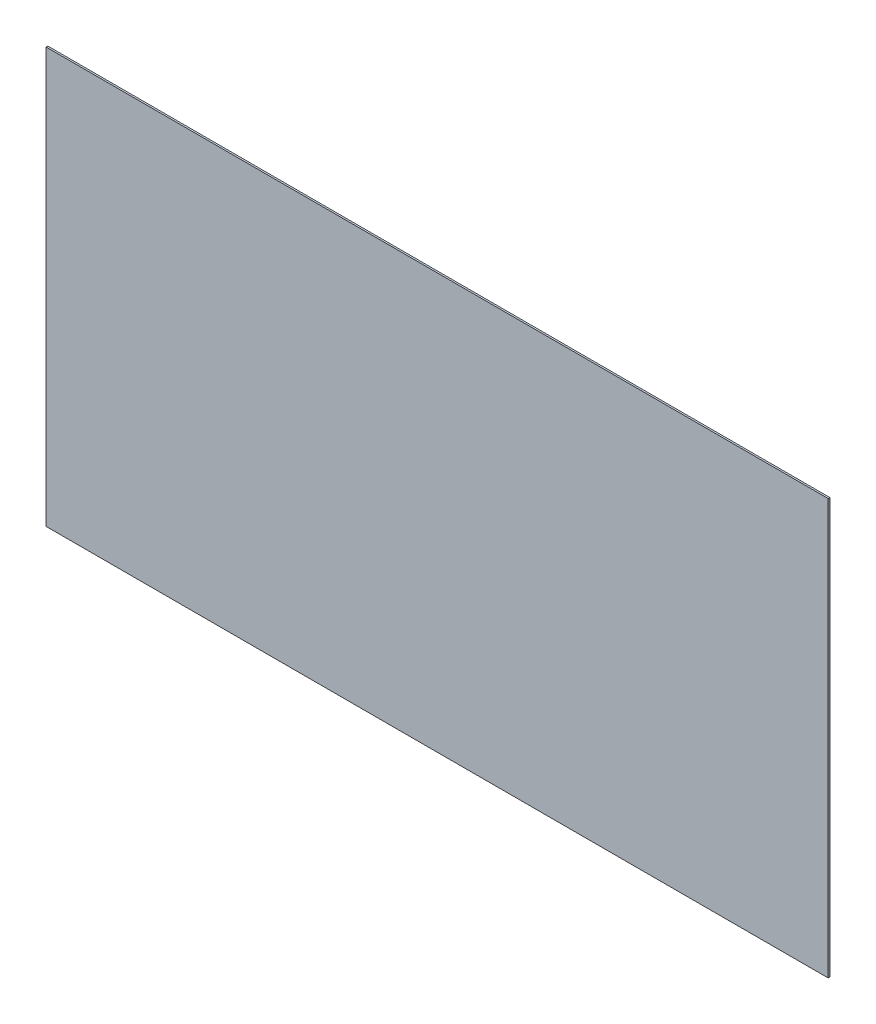
ISO-10303-21;
HEADER;
FILE_DESCRIPTION(('STEP AP214'),'2;1');
FILE_NAME('part.step','',(''),(''),'','','');
FILE_SCHEMA(('AUTOMOTIVE_DESIGN { 1 0 10303 214 1 1 1 1 }'));
ENDSEC;
DATA;
#1=APPLICATION_CONTEXT('core data for automotive mechanical design processes');
#2=APPLICATION_PROTOCOL_DEFINITION('international standard','automotive_design',2000,#1);
#3=PRODUCT_CONTEXT('',#1,'mechanical');
#4=PRODUCT('Part','Part','',(#3));
#5=PRODUCT_RELATED_PRODUCT_CATEGORY('part','',(#4));
#6=PRODUCT_DEFINITION_FORMATION('','',#4);
#7=PRODUCT_DEFINITION_CONTEXT('part definition',#1,'design');
#8=PRODUCT_DEFINITION('design','',#6,#7);
#9=PRODUCT_DEFINITION_SHAPE('','',#8);
#10=(LENGTH_UNIT() NAMED_UNIT(*) SI_UNIT(.MILLI.,.METRE.));
#11=(NAMED_UNIT(*) PLANE_ANGLE_UNIT() SI_UNIT($,.RADIAN.));
#12=(NAMED_UNIT(*) SI_UNIT($,.STERADIAN.) SOLID_ANGLE_UNIT());
#13=UNCERTAINTY_MEASURE_WITH_UNIT(LENGTH_MEASURE(1.E-05),#10,'distance_accuracy_value','');
#14=(GEOMETRIC_REPRESENTATION_CONTEXT(3) GLOBAL_UNCERTAINTY_ASSIGNED_CONTEXT((#13)) GLOBAL_UNIT_ASSIGNED_CONTEXT((#10,
#11,#12)) REPRESENTATION_CONTEXT('',''));
#15=CARTESIAN_POINT('',(0.,0.,0.));
#16=DIRECTION('',(0.,0.,1.));
#17=DIRECTION('',(1.,0.,0.));
#18=AXIS2_PLACEMENT_3D('',#15,#16,#17);
#19=CARTESIAN_POINT('',(0.,0.,1.5875));
#20=DIRECTION('',(1.,0.,0.));
#21=DIRECTION('',(0.,0.,-1.));
#22=AXIS2_PLACEMENT_3D('',#19,#20,#21);
#23=PLANE('',#22);
#24=DIRECTION('',(0.,-1.,0.));
#25=VECTOR('',#24,1.);
#26=CARTESIAN_POINT('',(0.,0.,0.));
#27=LINE('',#26,#25);
#28=CARTESIAN_POINT('',(0.,381.,0.));
#29=VERTEX_POINT('',#28);
#30=CARTESIAN_POINT('',(0.,0.,0.));
#31=VERTEX_POINT('',#30);
#32=EDGE_CURVE('E96',#29,#31,#27,.T.);
#33=ORIENTED_EDGE('',*,*,#32,.T.);
#34=DIRECTION('',(0.,0.,-1.));
#35=VECTOR('',#34,1.);
#36=CARTESIAN_POINT('',(0.,0.,1.5875));
#37=LINE('',#36,#35);
#38=CARTESIAN_POINT('',(0.,0.,1.5875));
#39=VERTEX_POINT('',#38);
#40=EDGE_CURVE('E11',#39,#31,#37,.T.);
#41=ORIENTED_EDGE('',*,*,#40,.F.);
#42=DIRECTION('',(0.,-1.,0.));
#43=VECTOR('',#42,1.);
#44=CARTESIAN_POINT('',(0.,0.,1.5875));
#45=LINE('',#44,#43);
#46=CARTESIAN_POINT('',(0.,381.,1.5875));
#47=VERTEX_POINT('',#46);
#48=EDGE_CURVE('E84',#47,#39,#45,.T.);
#49=ORIENTED_EDGE('',*,*,#48,.F.);
#50=DIRECTION('',(0.,0.,-1.));
#51=VECTOR('',#50,1.);
#52=CARTESIAN_POINT('',(0.,381.,1.5875));
#53=LINE('',#52,#51);
#54=EDGE_CURVE('E92',#47,#29,#53,.T.);
#55=ORIENTED_EDGE('',*,*,#54,.T.);
#56=EDGE_LOOP('',(#33,#41,#49,#55));
#57=FACE_BOUND('',#56,.T.);
#58=ADVANCED_FACE('F33',(#57),#23,.F.);
#59=CARTESIAN_POINT('',(0.,0.,1.5875));
#60=DIRECTION('',(0.,1.,0.));
#61=DIRECTION('',(0.,0.,1.));
#62=AXIS2_PLACEMENT_3D('',#59,#60,#61);
#63=PLANE('',#62);
#64=DIRECTION('',(1.,0.,0.));
#65=VECTOR('',#64,1.);
#66=CARTESIAN_POINT('',(0.,0.,0.));
#67=LINE('',#66,#65);
#68=CARTESIAN_POINT('',(717.804,0.,0.));
#69=VERTEX_POINT('',#68);
#70=EDGE_CURVE('E88',#31,#69,#67,.T.);
#71=ORIENTED_EDGE('',*,*,#70,.T.);
#72=DIRECTION('',(0.,0.,-1.));
#73=VECTOR('',#72,1.);
#74=CARTESIAN_POINT('',(717.804,0.,1.5875));
#75=LINE('',#74,#73);
#76=CARTESIAN_POINT('',(717.804,0.,1.5875));
#77=VERTEX_POINT('',#76);
#78=EDGE_CURVE('E41',#77,#69,#75,.T.);
#79=ORIENTED_EDGE('',*,*,#78,.F.);
#80=DIRECTION('',(1.,0.,0.));
#81=VECTOR('',#80,1.);
#82=CARTESIAN_POINT('',(0.,0.,1.5875));
#83=LINE('',#82,#81);
#84=EDGE_CURVE('E79',#39,#77,#83,.T.);
#85=ORIENTED_EDGE('',*,*,#84,.F.);
#86=ORIENTED_EDGE('',*,*,#40,.T.);
#87=EDGE_LOOP('',(#71,#79,#85,#86));
#88=FACE_BOUND('',#87,.T.);
#89=ADVANCED_FACE('F87',(#88),#63,.F.);
#90=CARTESIAN_POINT('',(717.804,0.,1.5875));
#91=DIRECTION('',(-1.,0.,0.));
#92=DIRECTION('',(0.,0.,1.));
#93=AXIS2_PLACEMENT_3D('',#90,#91,#92);
#94=PLANE('',#93);
#95=DIRECTION('',(0.,1.,0.));
#96=VECTOR('',#95,1.);
#97=CARTESIAN_POINT('',(717.804,0.,0.));
#98=LINE('',#97,#96);
#99=CARTESIAN_POINT('',(717.804,381.,0.));
#100=VERTEX_POINT('',#99);
#101=EDGE_CURVE('E66',#69,#100,#98,.T.);
#102=ORIENTED_EDGE('',*,*,#101,.T.);
#103=DIRECTION('',(0.,0.,-1.));
#104=VECTOR('',#103,1.);
#105=CARTESIAN_POINT('',(717.804,381.,1.5875));
#106=LINE('',#105,#104);
#107=CARTESIAN_POINT('',(717.804,381.,1.5875));
#108=VERTEX_POINT('',#107);
#109=EDGE_CURVE('E89',#108,#100,#106,.T.);
#110=ORIENTED_EDGE('',*,*,#109,.F.);
#111=DIRECTION('',(0.,1.,0.));
#112=VECTOR('',#111,1.);
#113=CARTESIAN_POINT('',(717.804,0.,1.5875));
#114=LINE('',#113,#112);
#115=EDGE_CURVE('E82',#77,#108,#114,.T.);
#116=ORIENTED_EDGE('',*,*,#115,.F.);
#117=ORIENTED_EDGE('',*,*,#78,.T.);
#118=EDGE_LOOP('',(#102,#110,#116,#117));
#119=FACE_BOUND('',#118,.T.);
#120=ADVANCED_FACE('F90',(#119),#94,.F.);
#121=CARTESIAN_POINT('',(0.,381.,1.5875));
#122=DIRECTION('',(0.,-1.,0.));
#123=DIRECTION('',(0.,0.,-1.));
#124=AXIS2_PLACEMENT_3D('',#121,#122,#123);
#125=PLANE('',#124);
#126=DIRECTION('',(-1.,0.,0.));
#127=VECTOR('',#126,1.);
#128=CARTESIAN_POINT('',(0.,381.,0.));
#129=LINE('',#128,#127);
#130=EDGE_CURVE('E72',#100,#29,#129,.T.);
#131=ORIENTED_EDGE('',*,*,#130,.T.);
#132=ORIENTED_EDGE('',*,*,#54,.F.);
#133=DIRECTION('',(-1.,0.,0.));
#134=VECTOR('',#133,1.);
#135=CARTESIAN_POINT('',(0.,381.,1.5875));
#136=LINE('',#135,#134);
#137=EDGE_CURVE('E49',#108,#47,#136,.T.);
#138=ORIENTED_EDGE('',*,*,#137,.F.);
#139=ORIENTED_EDGE('',*,*,#109,.T.);
#140=EDGE_LOOP('',(#131,#132,#138,#139));
#141=FACE_BOUND('',#140,.T.);
#142=ADVANCED_FACE('F103',(#141),#125,.F.);
#143=CARTESIAN_POINT('',(0.,0.,1.5875));
#144=DIRECTION('',(0.,0.,-1.));
#145=DIRECTION('',(-1.,0.,0.));
#146=AXIS2_PLACEMENT_3D('',#143,#144,#145);
#147=PLANE('',#146);
#148=ORIENTED_EDGE('',*,*,#48,.T.);
#149=ORIENTED_EDGE('',*,*,#84,.T.);
#150=ORIENTED_EDGE('',*,*,#115,.T.);
#151=ORIENTED_EDGE('',*,*,#137,.T.);
#152=EDGE_LOOP('',(#148,#149,#150,#151));
#153=FACE_BOUND('',#152,.T.);
#154=ADVANCED_FACE('F80',(#153),#147,.F.);
#155=CARTESIAN_POINT('',(0.,0.,0.));
#156=DIRECTION('',(0.,0.,-1.));
#157=DIRECTION('',(-1.,0.,0.));
#158=AXIS2_PLACEMENT_3D('',#155,#156,#157);
#159=PLANE('',#158);
#160=ORIENTED_EDGE('',*,*,#32,.F.);
#161=ORIENTED_EDGE('',*,*,#130,.F.);
#162=ORIENTED_EDGE('',*,*,#101,.F.);
#163=ORIENTED_EDGE('',*,*,#70,.F.);
#164=EDGE_LOOP('',(#160,#161,#162,#163));
#165=FACE_BOUND('',#164,.T.);
#166=ADVANCED_FACE('F106',(#165),#159,.T.);
#167=CLOSED_SHELL('',(#58,#89,#120,#142,#154,#166));
#168=MANIFOLD_SOLID_BREP('B2',#167);
#169=ADVANCED_BREP_SHAPE_REPRESENTATION('',(#18,#168),#14);
#170=SHAPE_DEFINITION_REPRESENTATION(#9,#169);
ENDSEC;
END-ISO-10303-21;
